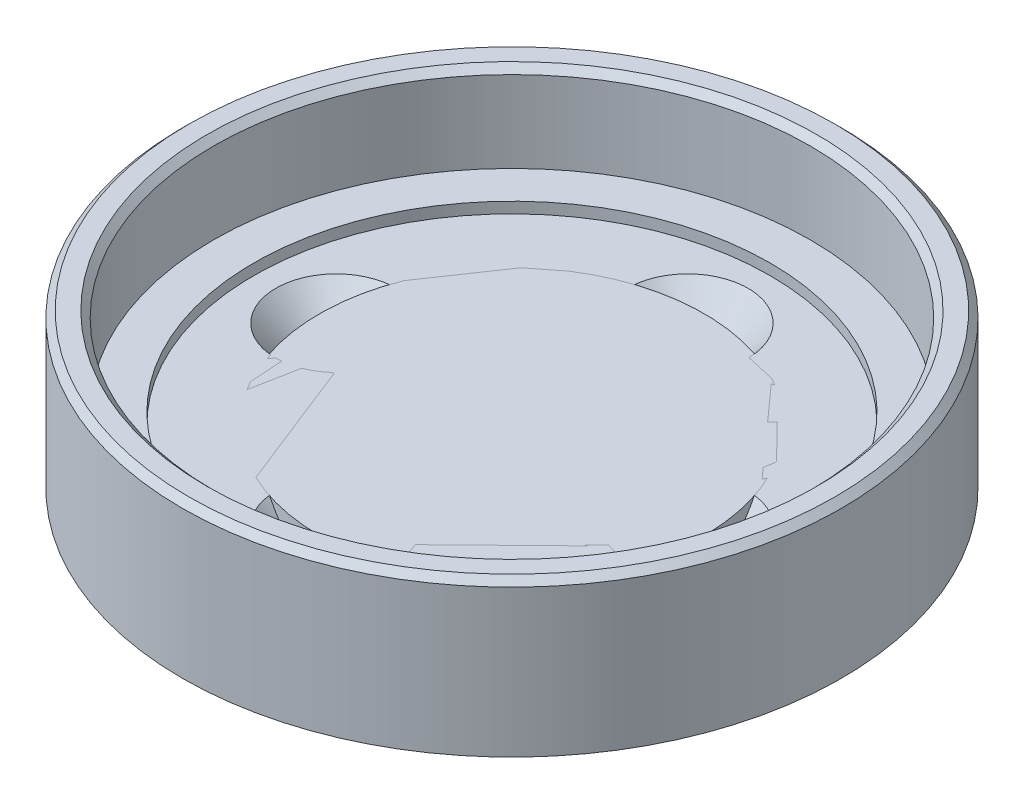
ISO-10303-21;
HEADER;
FILE_DESCRIPTION(('STEP AP214'),'2;1');
FILE_NAME('part.step','',(''),(''),'','','');
FILE_SCHEMA(('AUTOMOTIVE_DESIGN { 1 0 10303 214 1 1 1 1 }'));
ENDSEC;
DATA;
#1=APPLICATION_CONTEXT('core data for automotive mechanical design processes');
#2=APPLICATION_PROTOCOL_DEFINITION('international standard','automotive_design',2000,#1);
#3=PRODUCT_CONTEXT('',#1,'mechanical');
#4=PRODUCT('Part','Part','',(#3));
#5=PRODUCT_RELATED_PRODUCT_CATEGORY('part','',(#4));
#6=PRODUCT_DEFINITION_FORMATION('','',#4);
#7=PRODUCT_DEFINITION_CONTEXT('part definition',#1,'design');
#8=PRODUCT_DEFINITION('design','',#6,#7);
#9=PRODUCT_DEFINITION_SHAPE('','',#8);
#10=(LENGTH_UNIT() NAMED_UNIT(*) SI_UNIT(.MILLI.,.METRE.));
#11=(NAMED_UNIT(*) PLANE_ANGLE_UNIT() SI_UNIT($,.RADIAN.));
#12=(NAMED_UNIT(*) SI_UNIT($,.STERADIAN.) SOLID_ANGLE_UNIT());
#13=UNCERTAINTY_MEASURE_WITH_UNIT(LENGTH_MEASURE(1.E-05),#10,'distance_accuracy_value','');
#14=(GEOMETRIC_REPRESENTATION_CONTEXT(3) GLOBAL_UNCERTAINTY_ASSIGNED_CONTEXT((#13)) GLOBAL_UNIT_ASSIGNED_CONTEXT((#10,
#11,#12)) REPRESENTATION_CONTEXT('',''));
#15=CARTESIAN_POINT('',(0.,0.,0.));
#16=DIRECTION('',(0.,0.,1.));
#17=DIRECTION('',(1.,0.,0.));
#18=AXIS2_PLACEMENT_3D('',#15,#16,#17);
#19=CARTESIAN_POINT('',(0.,0.7,0.));
#20=DIRECTION('',(0.,1.,0.));
#21=DIRECTION('',(0.,0.,1.));
#22=AXIS2_PLACEMENT_3D('',#19,#20,#21);
#23=CYLINDRICAL_SURFACE('',#22,8.75);
#24=CARTESIAN_POINT('',(0.,0.7,0.));
#25=DIRECTION('',(0.,1.,0.));
#26=DIRECTION('',(0.,0.,1.));
#27=AXIS2_PLACEMENT_3D('',#24,#25,#26);
#28=CIRCLE('',#27,8.75);
#29=CARTESIAN_POINT('',(0.,0.7,8.75));
#30=VERTEX_POINT('',#29);
#31=EDGE_CURVE('E11',#30,#30,#28,.T.);
#32=ORIENTED_EDGE('',*,*,#31,.T.);
#33=EDGE_LOOP('',(#32));
#34=FACE_BOUND('',#33,.T.);
#35=CARTESIAN_POINT('',(0.,5.7,0.));
#36=DIRECTION('',(0.,1.,0.));
#37=DIRECTION('',(0.,0.,1.));
#38=AXIS2_PLACEMENT_3D('',#35,#36,#37);
#39=CIRCLE('',#38,8.75);
#40=CARTESIAN_POINT('',(0.,5.7,8.75));
#41=VERTEX_POINT('',#40);
#42=EDGE_CURVE('E46',#41,#41,#39,.T.);
#43=ORIENTED_EDGE('',*,*,#42,.F.);
#44=EDGE_LOOP('',(#43));
#45=FACE_BOUND('',#44,.T.);
#46=ADVANCED_FACE('F43',(#34,#45),#23,.T.);
#47=CARTESIAN_POINT('',(0.,0.7,0.));
#48=DIRECTION('',(0.,1.,0.));
#49=DIRECTION('',(0.,0.,1.));
#50=AXIS2_PLACEMENT_3D('',#47,#48,#49);
#51=PLANE('',#50);
#52=ORIENTED_EDGE('',*,*,#31,.F.);
#53=EDGE_LOOP('',(#52));
#54=FACE_BOUND('',#53,.T.);
#55=ADVANCED_FACE('F58',(#54),#51,.F.);
#56=CARTESIAN_POINT('',(0.,5.7,0.));
#57=DIRECTION('',(0.,1.,0.));
#58=DIRECTION('',(0.,0.,1.));
#59=AXIS2_PLACEMENT_3D('',#56,#57,#58);
#60=PLANE('',#59);
#61=ORIENTED_EDGE('',*,*,#42,.T.);
#62=EDGE_LOOP('',(#61));
#63=FACE_BOUND('',#62,.T.);
#64=ADVANCED_FACE('F55',(#63),#60,.T.);
#65=CLOSED_SHELL('',(#46,#55,#64));
#66=MANIFOLD_SOLID_BREP('B2_NOT_SHOWN',#65);
#67=CARTESIAN_POINT('',(0.,0.,0.));
#68=DIRECTION('',(0.,1.,0.));
#69=DIRECTION('',(0.,0.,1.));
#70=AXIS2_PLACEMENT_3D('',#67,#68,#69);
#71=CYLINDRICAL_SURFACE('',#70,1.65);
#72=CARTESIAN_POINT('',(0.,3.2,0.));
#73=DIRECTION('',(0.,1.,0.));
#74=DIRECTION('',(0.,0.,1.));
#75=AXIS2_PLACEMENT_3D('',#72,#73,#74);
#76=CIRCLE('',#75,1.65);
#77=CARTESIAN_POINT('',(0.,3.2,1.65));
#78=VERTEX_POINT('',#77);
#79=EDGE_CURVE('E104',#78,#78,#76,.F.);
#80=ORIENTED_EDGE('',*,*,#79,.T.);
#81=EDGE_LOOP('',(#80));
#82=FACE_BOUND('',#81,.T.);
#83=CARTESIAN_POINT('',(0.,5.,0.));
#84=DIRECTION('',(0.,1.,0.));
#85=DIRECTION('',(0.,0.,1.));
#86=AXIS2_PLACEMENT_3D('',#83,#84,#85);
#87=CIRCLE('',#86,1.65);
#88=CARTESIAN_POINT('',(0.,5.,1.65));
#89=VERTEX_POINT('',#88);
#90=EDGE_CURVE('E142',#89,#89,#87,.F.);
#91=ORIENTED_EDGE('',*,*,#90,.F.);
#92=EDGE_LOOP('',(#91));
#93=FACE_BOUND('',#92,.T.);
#94=ADVANCED_FACE('F84',(#82,#93),#71,.F.);
#95=CARTESIAN_POINT('',(0.,6.2,0.));
#96=DIRECTION('',(0.,1.,0.));
#97=DIRECTION('',(0.,0.,1.));
#98=AXIS2_PLACEMENT_3D('',#95,#96,#97);
#99=PLANE('',#98);
#100=CARTESIAN_POINT('',(0.,6.2,0.));
#101=DIRECTION('',(0.,1.,0.));
#102=DIRECTION('',(0.,0.,1.));
#103=AXIS2_PLACEMENT_3D('',#100,#101,#102);
#104=CIRCLE('',#103,11.75);
#105=CARTESIAN_POINT('',(0.,6.2,11.75));
#106=VERTEX_POINT('',#105);
#107=EDGE_CURVE('E148',#106,#106,#104,.T.);
#108=ORIENTED_EDGE('',*,*,#107,.F.);
#109=EDGE_LOOP('',(#108));
#110=FACE_BOUND('',#109,.T.);
#111=CARTESIAN_POINT('',(0.,6.2,0.));
#112=DIRECTION('',(0.,1.,0.));
#113=DIRECTION('',(0.,0.,1.));
#114=AXIS2_PLACEMENT_3D('',#111,#112,#113);
#115=CIRCLE('',#114,13.575);
#116=CARTESIAN_POINT('',(0.,6.2,13.575));
#117=VERTEX_POINT('',#116);
#118=EDGE_CURVE('E145',#117,#117,#115,.T.);
#119=ORIENTED_EDGE('',*,*,#118,.T.);
#120=EDGE_LOOP('',(#119));
#121=FACE_BOUND('',#120,.T.);
#122=ADVANCED_FACE('F180',(#110,#121),#99,.T.);
#123=CARTESIAN_POINT('',(0.,5.7,0.));
#124=DIRECTION('',(0.,1.,0.));
#125=DIRECTION('',(0.,0.,1.));
#126=AXIS2_PLACEMENT_3D('',#123,#124,#125);
#127=CYLINDRICAL_SURFACE('',#126,11.75);
#128=CARTESIAN_POINT('',(0.,5.7,0.));
#129=DIRECTION('',(0.,1.,0.));
#130=DIRECTION('',(0.,0.,1.));
#131=AXIS2_PLACEMENT_3D('',#128,#129,#130);
#132=CIRCLE('',#131,11.75);
#133=CARTESIAN_POINT('',(0.,5.7,11.75));
#134=VERTEX_POINT('',#133);
#135=EDGE_CURVE('E149',#134,#134,#132,.T.);
#136=ORIENTED_EDGE('',*,*,#135,.F.);
#137=EDGE_LOOP('',(#136));
#138=FACE_BOUND('',#137,.T.);
#139=ORIENTED_EDGE('',*,*,#107,.T.);
#140=EDGE_LOOP('',(#139));
#141=FACE_BOUND('',#140,.T.);
#142=ADVANCED_FACE('F186',(#138,#141),#127,.F.);
#143=CARTESIAN_POINT('',(0.,5.7,0.));
#144=DIRECTION('',(0.,1.,0.));
#145=DIRECTION('',(0.,0.,1.));
#146=AXIS2_PLACEMENT_3D('',#143,#144,#145);
#147=PLANE('',#146);
#148=CARTESIAN_POINT('',(0.,5.7,-8.));
#149=DIRECTION('',(0.,1.,0.));
#150=DIRECTION('',(0.,0.,1.));
#151=AXIS2_PLACEMENT_3D('',#148,#149,#150);
#152=CIRCLE('',#151,2.75);
#153=CARTESIAN_POINT('',(0.,5.7,-5.25));
#154=VERTEX_POINT('',#153);
#155=EDGE_CURVE('E260',#154,#154,#152,.T.);
#156=ORIENTED_EDGE('',*,*,#155,.F.);
#157=EDGE_LOOP('',(#156));
#158=FACE_BOUND('',#157,.T.);
#159=CARTESIAN_POINT('',(-7.99999999999977,5.7,2.27373675443232E-13));
#160=DIRECTION('',(0.,1.,0.));
#161=DIRECTION('',(0.,0.,1.));
#162=AXIS2_PLACEMENT_3D('',#159,#160,#161);
#163=CIRCLE('',#162,2.75);
#164=CARTESIAN_POINT('',(-7.99999999999977,5.7,2.75000000000023));
#165=VERTEX_POINT('',#164);
#166=EDGE_CURVE('E122',#165,#165,#163,.T.);
#167=ORIENTED_EDGE('',*,*,#166,.F.);
#168=EDGE_LOOP('',(#167));
#169=FACE_BOUND('',#168,.T.);
#170=CARTESIAN_POINT('',(8.00000000000023,5.7,-2.26393958003914E-13));
#171=DIRECTION('',(0.,1.,0.));
#172=DIRECTION('',(0.,0.,1.));
#173=AXIS2_PLACEMENT_3D('',#170,#171,#172);
#174=CIRCLE('',#173,2.75);
#175=CARTESIAN_POINT('',(8.00000000000023,5.7,2.74999999999977));
#176=VERTEX_POINT('',#175);
#177=EDGE_CURVE('E115',#176,#176,#174,.T.);
#178=ORIENTED_EDGE('',*,*,#177,.F.);
#179=EDGE_LOOP('',(#178));
#180=FACE_BOUND('',#179,.T.);
#181=CARTESIAN_POINT('',(4.52787916007828E-13,5.7,8.));
#182=DIRECTION('',(0.,1.,0.));
#183=DIRECTION('',(0.,0.,1.));
#184=AXIS2_PLACEMENT_3D('',#181,#182,#183);
#185=CIRCLE('',#184,2.75);
#186=CARTESIAN_POINT('',(4.52787916007828E-13,5.7,10.75));
#187=VERTEX_POINT('',#186);
#188=EDGE_CURVE('E111',#187,#187,#185,.T.);
#189=ORIENTED_EDGE('',*,*,#188,.F.);
#190=EDGE_LOOP('',(#189));
#191=FACE_BOUND('',#190,.T.);
#192=CARTESIAN_POINT('',(0.,5.7,0.));
#193=DIRECTION('',(0.,1.,0.));
#194=DIRECTION('',(0.,0.,1.));
#195=AXIS2_PLACEMENT_3D('',#192,#193,#194);
#196=CIRCLE('',#195,2.9);
#197=CARTESIAN_POINT('',(0.,5.7,2.9));
#198=VERTEX_POINT('',#197);
#199=EDGE_CURVE('E138',#198,#198,#196,.T.);
#200=ORIENTED_EDGE('',*,*,#199,.F.);
#201=EDGE_LOOP('',(#200));
#202=FACE_BOUND('',#201,.T.);
#203=ORIENTED_EDGE('',*,*,#135,.T.);
#204=EDGE_LOOP('',(#203));
#205=FACE_BOUND('',#204,.T.);
#206=ADVANCED_FACE('F198',(#158,#169,#180,#191,#202,#205),#147,.T.);
#207=CARTESIAN_POINT('',(0.,10.2,0.));
#208=DIRECTION('',(0.,1.,0.));
#209=DIRECTION('',(0.,0.,1.));
#210=AXIS2_PLACEMENT_3D('',#207,#208,#209);
#211=PLANE('',#210);
#212=CARTESIAN_POINT('',(0.,10.2,0.));
#213=DIRECTION('',(0.,1.,0.));
#214=DIRECTION('',(0.,0.,1.));
#215=AXIS2_PLACEMENT_3D('',#212,#213,#214);
#216=CIRCLE('',#215,14.7);
#217=CARTESIAN_POINT('',(0.,10.2,14.7));
#218=VERTEX_POINT('',#217);
#219=EDGE_CURVE('E97',#218,#218,#216,.T.);
#220=ORIENTED_EDGE('',*,*,#219,.T.);
#221=EDGE_LOOP('',(#220));
#222=FACE_BOUND('',#221,.T.);
#223=CARTESIAN_POINT('',(0.,10.2,0.));
#224=DIRECTION('',(0.,1.,0.));
#225=DIRECTION('',(0.,0.,1.));
#226=AXIS2_PLACEMENT_3D('',#223,#224,#225);
#227=CIRCLE('',#226,13.875);
#228=CARTESIAN_POINT('',(0.,10.2,13.875));
#229=VERTEX_POINT('',#228);
#230=EDGE_CURVE('E152',#229,#229,#227,.F.);
#231=ORIENTED_EDGE('',*,*,#230,.T.);
#232=EDGE_LOOP('',(#231));
#233=FACE_BOUND('',#232,.T.);
#234=ADVANCED_FACE('F161',(#222,#233),#211,.T.);
#235=CARTESIAN_POINT('',(0.,10.2,0.));
#236=DIRECTION('',(0.,-1.,0.));
#237=DIRECTION('',(0.,0.,-1.));
#238=AXIS2_PLACEMENT_3D('',#235,#236,#237);
#239=CYLINDRICAL_SURFACE('',#238,13.575);
#240=CARTESIAN_POINT('',(0.,9.90000000000001,0.));
#241=DIRECTION('',(0.,1.,0.));
#242=DIRECTION('',(0.,0.,1.));
#243=AXIS2_PLACEMENT_3D('',#240,#241,#242);
#244=CIRCLE('',#243,13.575);
#245=CARTESIAN_POINT('',(0.,9.90000000000001,13.575));
#246=VERTEX_POINT('',#245);
#247=EDGE_CURVE('E42',#246,#246,#244,.T.);
#248=ORIENTED_EDGE('',*,*,#247,.T.);
#249=EDGE_LOOP('',(#248));
#250=FACE_BOUND('',#249,.T.);
#251=ORIENTED_EDGE('',*,*,#118,.F.);
#252=EDGE_LOOP('',(#251));
#253=FACE_BOUND('',#252,.T.);
#254=ADVANCED_FACE('F192',(#250,#253),#239,.F.);
#255=CARTESIAN_POINT('',(0.,6.2,0.));
#256=DIRECTION('',(0.,-1.,0.));
#257=DIRECTION('',(0.,0.,-1.));
#258=AXIS2_PLACEMENT_3D('',#255,#256,#257);
#259=CYLINDRICAL_SURFACE('',#258,15.);
#260=CARTESIAN_POINT('',(0.,3.2,0.));
#261=DIRECTION('',(0.,1.,0.));
#262=DIRECTION('',(0.,0.,1.));
#263=AXIS2_PLACEMENT_3D('',#260,#261,#262);
#264=CIRCLE('',#263,15.);
#265=CARTESIAN_POINT('',(0.,3.2,15.));
#266=VERTEX_POINT('',#265);
#267=EDGE_CURVE('E101',#266,#266,#264,.T.);
#268=ORIENTED_EDGE('',*,*,#267,.T.);
#269=EDGE_LOOP('',(#268));
#270=FACE_BOUND('',#269,.T.);
#271=CARTESIAN_POINT('',(0.,9.90000000000003,0.));
#272=DIRECTION('',(0.,1.,0.));
#273=DIRECTION('',(0.,0.,1.));
#274=AXIS2_PLACEMENT_3D('',#271,#272,#273);
#275=CIRCLE('',#274,15.);
#276=CARTESIAN_POINT('',(0.,9.90000000000003,15.));
#277=VERTEX_POINT('',#276);
#278=EDGE_CURVE('E92',#277,#277,#275,.F.);
#279=ORIENTED_EDGE('',*,*,#278,.T.);
#280=EDGE_LOOP('',(#279));
#281=FACE_BOUND('',#280,.T.);
#282=ADVANCED_FACE('F195',(#270,#281),#259,.T.);
#283=CARTESIAN_POINT('',(0.,5.,0.));
#284=DIRECTION('',(0.,1.,0.));
#285=DIRECTION('',(0.,0.,1.));
#286=AXIS2_PLACEMENT_3D('',#283,#284,#285);
#287=PLANE('',#286);
#288=CARTESIAN_POINT('',(0.,5.,0.));
#289=DIRECTION('',(0.,1.,0.));
#290=DIRECTION('',(0.,0.,1.));
#291=AXIS2_PLACEMENT_3D('',#288,#289,#290);
#292=CIRCLE('',#291,2.9);
#293=CARTESIAN_POINT('',(0.,5.,2.9));
#294=VERTEX_POINT('',#293);
#295=EDGE_CURVE('E139',#294,#294,#292,.T.);
#296=ORIENTED_EDGE('',*,*,#295,.T.);
#297=EDGE_LOOP('',(#296));
#298=FACE_BOUND('',#297,.T.);
#299=ORIENTED_EDGE('',*,*,#90,.T.);
#300=EDGE_LOOP('',(#299));
#301=FACE_BOUND('',#300,.T.);
#302=ADVANCED_FACE('F174',(#298,#301),#287,.T.);
#303=CARTESIAN_POINT('',(0.,5.,0.));
#304=DIRECTION('',(0.,1.,0.));
#305=DIRECTION('',(0.,0.,1.));
#306=AXIS2_PLACEMENT_3D('',#303,#304,#305);
#307=CYLINDRICAL_SURFACE('',#306,2.9);
#308=ORIENTED_EDGE('',*,*,#295,.F.);
#309=EDGE_LOOP('',(#308));
#310=FACE_BOUND('',#309,.T.);
#311=ORIENTED_EDGE('',*,*,#199,.T.);
#312=EDGE_LOOP('',(#311));
#313=FACE_BOUND('',#312,.T.);
#314=ADVANCED_FACE('F166',(#310,#313),#307,.F.);
#315=CARTESIAN_POINT('',(0.,10.2,0.));
#316=DIRECTION('',(0.,-1.,0.));
#317=DIRECTION('',(0.,0.,-1.));
#318=AXIS2_PLACEMENT_3D('',#315,#316,#317);
#319=CONICAL_SURFACE('',#318,14.7,0.78539816339744);
#320=ORIENTED_EDGE('',*,*,#278,.F.);
#321=EDGE_LOOP('',(#320));
#322=FACE_BOUND('',#321,.T.);
#323=ORIENTED_EDGE('',*,*,#219,.F.);
#324=EDGE_LOOP('',(#323));
#325=FACE_BOUND('',#324,.T.);
#326=ADVANCED_FACE('F164',(#322,#325),#319,.T.);
#327=CARTESIAN_POINT('',(0.,9.90000000000001,0.));
#328=DIRECTION('',(0.,1.,0.));
#329=DIRECTION('',(0.,0.,1.));
#330=AXIS2_PLACEMENT_3D('',#327,#328,#329);
#331=CONICAL_SURFACE('',#330,13.575,0.785398163397448);
#332=ORIENTED_EDGE('',*,*,#230,.F.);
#333=EDGE_LOOP('',(#332));
#334=FACE_BOUND('',#333,.T.);
#335=ORIENTED_EDGE('',*,*,#247,.F.);
#336=EDGE_LOOP('',(#335));
#337=FACE_BOUND('',#336,.T.);
#338=ADVANCED_FACE('F86',(#334,#337),#331,.F.);
#339=CARTESIAN_POINT('',(0.,3.2,0.));
#340=DIRECTION('',(0.,1.,0.));
#341=DIRECTION('',(0.,0.,1.));
#342=AXIS2_PLACEMENT_3D('',#339,#340,#341);
#343=PLANE('',#342);
#344=CARTESIAN_POINT('',(0.,3.2,-8.));
#345=DIRECTION('',(0.,1.,0.));
#346=DIRECTION('',(0.,0.,1.));
#347=AXIS2_PLACEMENT_3D('',#344,#345,#346);
#348=CIRCLE('',#347,1.4);
#349=CARTESIAN_POINT('',(0.,3.2,-6.6));
#350=VERTEX_POINT('',#349);
#351=EDGE_CURVE('E88',#350,#350,#348,.T.);
#352=ORIENTED_EDGE('',*,*,#351,.T.);
#353=EDGE_LOOP('',(#352));
#354=FACE_BOUND('',#353,.T.);
#355=CARTESIAN_POINT('',(-7.99999999999977,3.2,2.27373675443232E-13));
#356=DIRECTION('',(0.,1.,0.));
#357=DIRECTION('',(0.,0.,1.));
#358=AXIS2_PLACEMENT_3D('',#355,#356,#357);
#359=CIRCLE('',#358,1.4);
#360=CARTESIAN_POINT('',(-7.99999999999977,3.2,1.40000000000023));
#361=VERTEX_POINT('',#360);
#362=EDGE_CURVE('E113',#361,#361,#359,.T.);
#363=ORIENTED_EDGE('',*,*,#362,.T.);
#364=EDGE_LOOP('',(#363));
#365=FACE_BOUND('',#364,.T.);
#366=CARTESIAN_POINT('',(8.00000000000023,3.2,-2.26393958003914E-13));
#367=DIRECTION('',(0.,1.,0.));
#368=DIRECTION('',(0.,0.,1.));
#369=AXIS2_PLACEMENT_3D('',#366,#367,#368);
#370=CIRCLE('',#369,1.4);
#371=CARTESIAN_POINT('',(8.00000000000023,3.2,1.39999999999977));
#372=VERTEX_POINT('',#371);
#373=EDGE_CURVE('E109',#372,#372,#370,.T.);
#374=ORIENTED_EDGE('',*,*,#373,.T.);
#375=EDGE_LOOP('',(#374));
#376=FACE_BOUND('',#375,.T.);
#377=CARTESIAN_POINT('',(4.52787916007828E-13,3.2,8.));
#378=DIRECTION('',(0.,1.,0.));
#379=DIRECTION('',(0.,0.,1.));
#380=AXIS2_PLACEMENT_3D('',#377,#378,#379);
#381=CIRCLE('',#380,1.4);
#382=CARTESIAN_POINT('',(4.52787916007828E-13,3.2,9.4));
#383=VERTEX_POINT('',#382);
#384=EDGE_CURVE('E105',#383,#383,#381,.T.);
#385=ORIENTED_EDGE('',*,*,#384,.T.);
#386=EDGE_LOOP('',(#385));
#387=FACE_BOUND('',#386,.T.);
#388=ORIENTED_EDGE('',*,*,#267,.F.);
#389=EDGE_LOOP('',(#388));
#390=FACE_BOUND('',#389,.T.);
#391=ORIENTED_EDGE('',*,*,#79,.F.);
#392=EDGE_LOOP('',(#391));
#393=FACE_BOUND('',#392,.T.);
#394=ADVANCED_FACE('F172',(#354,#365,#376,#387,#390,#393),#343,.F.);
#395=CARTESIAN_POINT('',(4.52787916007828E-13,5.7,8.));
#396=DIRECTION('',(0.,1.,0.));
#397=DIRECTION('',(0.,0.,1.));
#398=AXIS2_PLACEMENT_3D('',#395,#396,#397);
#399=CYLINDRICAL_SURFACE('',#398,1.4);
#400=CARTESIAN_POINT('',(4.52787916007828E-13,4.35,8.));
#401=DIRECTION('',(0.,1.,0.));
#402=DIRECTION('',(0.,0.,1.));
#403=AXIS2_PLACEMENT_3D('',#400,#401,#402);
#404=CIRCLE('',#403,1.4);
#405=CARTESIAN_POINT('',(4.52787916007828E-13,4.35,9.4));
#406=VERTEX_POINT('',#405);
#407=EDGE_CURVE('E108',#406,#406,#404,.T.);
#408=ORIENTED_EDGE('',*,*,#407,.T.);
#409=EDGE_LOOP('',(#408));
#410=FACE_BOUND('',#409,.T.);
#411=ORIENTED_EDGE('',*,*,#384,.F.);
#412=EDGE_LOOP('',(#411));
#413=FACE_BOUND('',#412,.T.);
#414=ADVANCED_FACE('F215',(#410,#413),#399,.F.);
#415=CARTESIAN_POINT('',(4.52787916007828E-13,5.7,8.));
#416=DIRECTION('',(0.,1.,0.));
#417=DIRECTION('',(0.,0.,1.));
#418=AXIS2_PLACEMENT_3D('',#415,#416,#417);
#419=CONICAL_SURFACE('',#418,2.75,0.785398163397449);
#420=ORIENTED_EDGE('',*,*,#407,.F.);
#421=EDGE_LOOP('',(#420));
#422=FACE_BOUND('',#421,.T.);
#423=ORIENTED_EDGE('',*,*,#188,.T.);
#424=EDGE_LOOP('',(#423));
#425=FACE_BOUND('',#424,.T.);
#426=ADVANCED_FACE('F222',(#422,#425),#419,.F.);
#427=CARTESIAN_POINT('',(8.00000000000023,5.7,-2.26393958003914E-13));
#428=DIRECTION('',(0.,1.,0.));
#429=DIRECTION('',(0.,0.,1.));
#430=AXIS2_PLACEMENT_3D('',#427,#428,#429);
#431=CYLINDRICAL_SURFACE('',#430,1.4);
#432=CARTESIAN_POINT('',(8.00000000000023,4.35,-2.26393958003914E-13));
#433=DIRECTION('',(0.,1.,0.));
#434=DIRECTION('',(0.,0.,1.));
#435=AXIS2_PLACEMENT_3D('',#432,#433,#434);
#436=CIRCLE('',#435,1.4);
#437=CARTESIAN_POINT('',(8.00000000000023,4.35,1.39999999999977));
#438=VERTEX_POINT('',#437);
#439=EDGE_CURVE('E112',#438,#438,#436,.T.);
#440=ORIENTED_EDGE('',*,*,#439,.T.);
#441=EDGE_LOOP('',(#440));
#442=FACE_BOUND('',#441,.T.);
#443=ORIENTED_EDGE('',*,*,#373,.F.);
#444=EDGE_LOOP('',(#443));
#445=FACE_BOUND('',#444,.T.);
#446=ADVANCED_FACE('F229',(#442,#445),#431,.F.);
#447=CARTESIAN_POINT('',(8.00000000000023,5.7,-2.26393958003914E-13));
#448=DIRECTION('',(0.,1.,0.));
#449=DIRECTION('',(0.,0.,1.));
#450=AXIS2_PLACEMENT_3D('',#447,#448,#449);
#451=CONICAL_SURFACE('',#450,2.75,0.785398163397449);
#452=ORIENTED_EDGE('',*,*,#439,.F.);
#453=EDGE_LOOP('',(#452));
#454=FACE_BOUND('',#453,.T.);
#455=ORIENTED_EDGE('',*,*,#177,.T.);
#456=EDGE_LOOP('',(#455));
#457=FACE_BOUND('',#456,.T.);
#458=ADVANCED_FACE('F233',(#454,#457),#451,.F.);
#459=CARTESIAN_POINT('',(-7.99999999999977,5.7,2.27373675443232E-13));
#460=DIRECTION('',(0.,1.,0.));
#461=DIRECTION('',(0.,0.,1.));
#462=AXIS2_PLACEMENT_3D('',#459,#460,#461);
#463=CYLINDRICAL_SURFACE('',#462,1.4);
#464=CARTESIAN_POINT('',(-7.99999999999977,4.35,2.27373675443232E-13));
#465=DIRECTION('',(0.,1.,0.));
#466=DIRECTION('',(0.,0.,1.));
#467=AXIS2_PLACEMENT_3D('',#464,#465,#466);
#468=CIRCLE('',#467,1.4);
#469=CARTESIAN_POINT('',(-7.99999999999977,4.35,1.40000000000023));
#470=VERTEX_POINT('',#469);
#471=EDGE_CURVE('E116',#470,#470,#468,.T.);
#472=ORIENTED_EDGE('',*,*,#471,.T.);
#473=EDGE_LOOP('',(#472));
#474=FACE_BOUND('',#473,.T.);
#475=ORIENTED_EDGE('',*,*,#362,.F.);
#476=EDGE_LOOP('',(#475));
#477=FACE_BOUND('',#476,.T.);
#478=ADVANCED_FACE('F237',(#474,#477),#463,.F.);
#479=CARTESIAN_POINT('',(-7.99999999999977,5.7,2.27373675443232E-13));
#480=DIRECTION('',(0.,1.,0.));
#481=DIRECTION('',(0.,0.,1.));
#482=AXIS2_PLACEMENT_3D('',#479,#480,#481);
#483=CONICAL_SURFACE('',#482,2.75,0.785398163397449);
#484=ORIENTED_EDGE('',*,*,#471,.F.);
#485=EDGE_LOOP('',(#484));
#486=FACE_BOUND('',#485,.T.);
#487=ORIENTED_EDGE('',*,*,#166,.T.);
#488=EDGE_LOOP('',(#487));
#489=FACE_BOUND('',#488,.T.);
#490=ADVANCED_FACE('F241',(#486,#489),#483,.F.);
#491=CARTESIAN_POINT('',(0.,5.7,-8.));
#492=DIRECTION('',(0.,1.,0.));
#493=DIRECTION('',(0.,0.,1.));
#494=AXIS2_PLACEMENT_3D('',#491,#492,#493);
#495=CYLINDRICAL_SURFACE('',#494,1.4);
#496=CARTESIAN_POINT('',(0.,4.35,-8.));
#497=DIRECTION('',(0.,1.,0.));
#498=DIRECTION('',(0.,0.,1.));
#499=AXIS2_PLACEMENT_3D('',#496,#497,#498);
#500=CIRCLE('',#499,1.4);
#501=CARTESIAN_POINT('',(0.,4.35,-6.6));
#502=VERTEX_POINT('',#501);
#503=EDGE_CURVE('E257',#502,#502,#500,.T.);
#504=ORIENTED_EDGE('',*,*,#503,.T.);
#505=EDGE_LOOP('',(#504));
#506=FACE_BOUND('',#505,.T.);
#507=ORIENTED_EDGE('',*,*,#351,.F.);
#508=EDGE_LOOP('',(#507));
#509=FACE_BOUND('',#508,.T.);
#510=ADVANCED_FACE('F244',(#506,#509),#495,.F.);
#511=CARTESIAN_POINT('',(0.,5.7,-8.));
#512=DIRECTION('',(0.,1.,0.));
#513=DIRECTION('',(0.,0.,1.));
#514=AXIS2_PLACEMENT_3D('',#511,#512,#513);
#515=CONICAL_SURFACE('',#514,2.75,0.785398163397449);
#516=ORIENTED_EDGE('',*,*,#503,.F.);
#517=EDGE_LOOP('',(#516));
#518=FACE_BOUND('',#517,.T.);
#519=ORIENTED_EDGE('',*,*,#155,.T.);
#520=EDGE_LOOP('',(#519));
#521=FACE_BOUND('',#520,.T.);
#522=ADVANCED_FACE('F248',(#518,#521),#515,.F.);
#523=CLOSED_SHELL('',(#94,#122,#142,#206,#234,#254,#282,#302,#314,#326,#338,#394,#414,#426,#446,
#458,#478,#490,#510,#522));
#524=MANIFOLD_SOLID_BREP('B6',#523);
#525=ADVANCED_BREP_SHAPE_REPRESENTATION('',(#18,#66,#524),#14);
#526=SHAPE_DEFINITION_REPRESENTATION(#9,#525);
ENDSEC;
END-ISO-10303-21;
